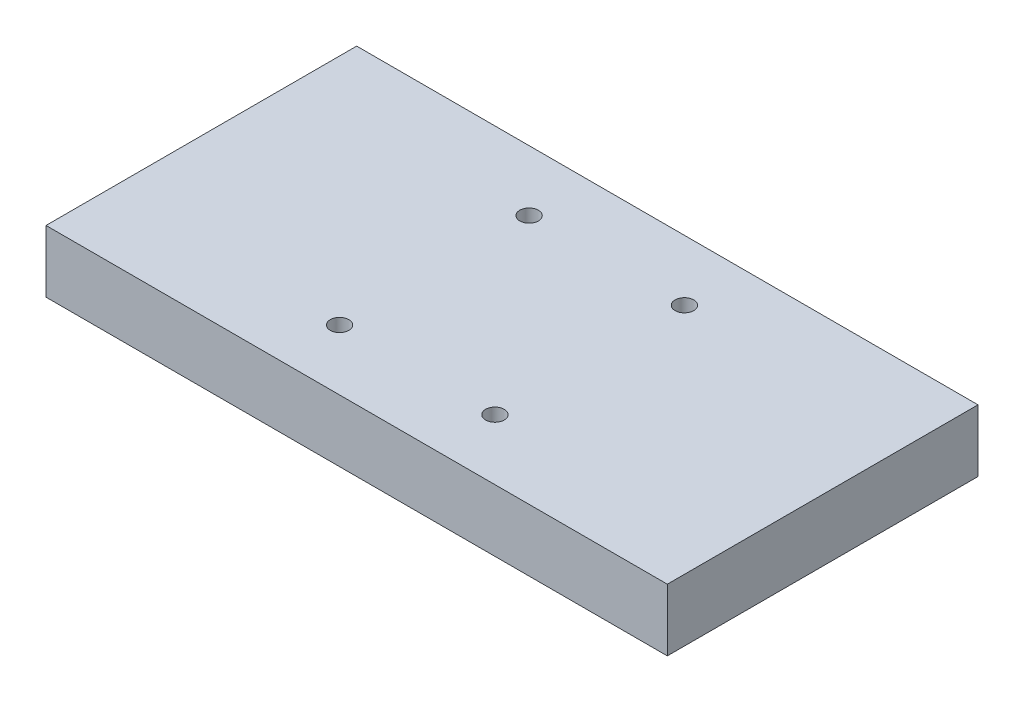
ISO-10303-21;
HEADER;
FILE_DESCRIPTION(('STEP AP214'),'2;1');
FILE_NAME('part.step','',(''),(''),'','','');
FILE_SCHEMA(('AUTOMOTIVE_DESIGN { 1 0 10303 214 1 1 1 1 }'));
ENDSEC;
DATA;
#1=APPLICATION_CONTEXT('core data for automotive mechanical design processes');
#2=APPLICATION_PROTOCOL_DEFINITION('international standard','automotive_design',2000,#1);
#3=PRODUCT_CONTEXT('',#1,'mechanical');
#4=PRODUCT('Part','Part','',(#3));
#5=PRODUCT_RELATED_PRODUCT_CATEGORY('part','',(#4));
#6=PRODUCT_DEFINITION_FORMATION('','',#4);
#7=PRODUCT_DEFINITION_CONTEXT('part definition',#1,'design');
#8=PRODUCT_DEFINITION('design','',#6,#7);
#9=PRODUCT_DEFINITION_SHAPE('','',#8);
#10=(LENGTH_UNIT() NAMED_UNIT(*) SI_UNIT(.MILLI.,.METRE.));
#11=(NAMED_UNIT(*) PLANE_ANGLE_UNIT() SI_UNIT($,.RADIAN.));
#12=(NAMED_UNIT(*) SI_UNIT($,.STERADIAN.) SOLID_ANGLE_UNIT());
#13=UNCERTAINTY_MEASURE_WITH_UNIT(LENGTH_MEASURE(1.E-05),#10,'distance_accuracy_value','');
#14=(GEOMETRIC_REPRESENTATION_CONTEXT(3) GLOBAL_UNCERTAINTY_ASSIGNED_CONTEXT((#13)) GLOBAL_UNIT_ASSIGNED_CONTEXT((#10,
#11,#12)) REPRESENTATION_CONTEXT('',''));
#15=CARTESIAN_POINT('',(0.,0.,0.));
#16=DIRECTION('',(0.,0.,1.));
#17=DIRECTION('',(1.,0.,0.));
#18=AXIS2_PLACEMENT_3D('',#15,#16,#17);
#19=CARTESIAN_POINT('',(-25.,-8.4852813742386,-30.5));
#20=DIRECTION('',(0.,1.,0.));
#21=DIRECTION('',(0.,0.,1.));
#22=AXIS2_PLACEMENT_3D('',#19,#20,#21);
#23=CYLINDRICAL_SURFACE('',#22,3.);
#24=CARTESIAN_POINT('',(-25.,20.,-30.5));
#25=DIRECTION('',(0.,1.,0.));
#26=DIRECTION('',(0.,0.,1.));
#27=AXIS2_PLACEMENT_3D('',#24,#25,#26);
#28=CIRCLE('',#27,3.);
#29=CARTESIAN_POINT('',(-25.,20.,-27.5));
#30=VERTEX_POINT('',#29);
#31=EDGE_CURVE('E114',#30,#30,#28,.T.);
#32=ORIENTED_EDGE('',*,*,#31,.T.);
#33=EDGE_LOOP('',(#32));
#34=FACE_BOUND('',#33,.T.);
#35=CARTESIAN_POINT('',(-25.,10.,-30.5));
#36=DIRECTION('',(0.,-1.,0.));
#37=DIRECTION('',(0.,0.,-1.));
#38=AXIS2_PLACEMENT_3D('',#35,#36,#37);
#39=CIRCLE('',#38,3.);
#40=CARTESIAN_POINT('',(-25.,10.,-33.5));
#41=VERTEX_POINT('',#40);
#42=EDGE_CURVE('E42',#41,#41,#39,.F.);
#43=ORIENTED_EDGE('',*,*,#42,.F.);
#44=EDGE_LOOP('',(#43));
#45=FACE_BOUND('',#44,.T.);
#46=ADVANCED_FACE('F38',(#34,#45),#23,.F.);
#47=CARTESIAN_POINT('',(24.9999999999999,-8.4852813742386,30.5));
#48=DIRECTION('',(0.,1.,0.));
#49=DIRECTION('',(0.,0.,1.));
#50=AXIS2_PLACEMENT_3D('',#47,#48,#49);
#51=CYLINDRICAL_SURFACE('',#50,2.99999999999999);
#52=CARTESIAN_POINT('',(24.9999999999999,20.,30.5));
#53=DIRECTION('',(0.,1.,0.));
#54=DIRECTION('',(0.,0.,1.));
#55=AXIS2_PLACEMENT_3D('',#52,#53,#54);
#56=CIRCLE('',#55,2.99999999999999);
#57=CARTESIAN_POINT('',(24.9999999999999,20.,33.5));
#58=VERTEX_POINT('',#57);
#59=EDGE_CURVE('E151',#58,#58,#56,.T.);
#60=ORIENTED_EDGE('',*,*,#59,.T.);
#61=EDGE_LOOP('',(#60));
#62=FACE_BOUND('',#61,.T.);
#63=CARTESIAN_POINT('',(24.9999999999999,10.,30.5));
#64=DIRECTION('',(0.,-1.,0.));
#65=DIRECTION('',(0.,0.,-1.));
#66=AXIS2_PLACEMENT_3D('',#63,#64,#65);
#67=CIRCLE('',#66,2.99999999999999);
#68=CARTESIAN_POINT('',(24.9999999999999,10.,27.5));
#69=VERTEX_POINT('',#68);
#70=EDGE_CURVE('E133',#69,#69,#67,.F.);
#71=ORIENTED_EDGE('',*,*,#70,.F.);
#72=EDGE_LOOP('',(#71));
#73=FACE_BOUND('',#72,.T.);
#74=ADVANCED_FACE('F227',(#62,#73),#51,.F.);
#75=CARTESIAN_POINT('',(-25.0000000000001,-8.4852813742386,30.5));
#76=DIRECTION('',(0.,1.,0.));
#77=DIRECTION('',(0.,0.,1.));
#78=AXIS2_PLACEMENT_3D('',#75,#76,#77);
#79=CYLINDRICAL_SURFACE('',#78,3.);
#80=CARTESIAN_POINT('',(-25.0000000000001,20.,30.5));
#81=DIRECTION('',(0.,1.,0.));
#82=DIRECTION('',(0.,0.,1.));
#83=AXIS2_PLACEMENT_3D('',#80,#81,#82);
#84=CIRCLE('',#83,3.);
#85=CARTESIAN_POINT('',(-25.0000000000001,20.,33.5));
#86=VERTEX_POINT('',#85);
#87=EDGE_CURVE('E145',#86,#86,#84,.T.);
#88=ORIENTED_EDGE('',*,*,#87,.T.);
#89=EDGE_LOOP('',(#88));
#90=FACE_BOUND('',#89,.T.);
#91=CARTESIAN_POINT('',(-25.0000000000001,10.,30.5));
#92=DIRECTION('',(0.,-1.,0.));
#93=DIRECTION('',(0.,0.,-1.));
#94=AXIS2_PLACEMENT_3D('',#91,#92,#93);
#95=CIRCLE('',#94,3.);
#96=CARTESIAN_POINT('',(-25.0000000000001,10.,27.5));
#97=VERTEX_POINT('',#96);
#98=EDGE_CURVE('E129',#97,#97,#95,.F.);
#99=ORIENTED_EDGE('',*,*,#98,.F.);
#100=EDGE_LOOP('',(#99));
#101=FACE_BOUND('',#100,.T.);
#102=ADVANCED_FACE('F234',(#90,#101),#79,.F.);
#103=CARTESIAN_POINT('',(25.,-8.4852813742386,-30.5));
#104=DIRECTION('',(0.,1.,0.));
#105=DIRECTION('',(0.,0.,1.));
#106=AXIS2_PLACEMENT_3D('',#103,#104,#105);
#107=CYLINDRICAL_SURFACE('',#106,3.00000000000001);
#108=CARTESIAN_POINT('',(25.,20.,-30.5));
#109=DIRECTION('',(0.,1.,0.));
#110=DIRECTION('',(0.,0.,1.));
#111=AXIS2_PLACEMENT_3D('',#108,#109,#110);
#112=CIRCLE('',#111,3.00000000000001);
#113=CARTESIAN_POINT('',(25.,20.,-27.5));
#114=VERTEX_POINT('',#113);
#115=EDGE_CURVE('E140',#114,#114,#112,.T.);
#116=ORIENTED_EDGE('',*,*,#115,.T.);
#117=EDGE_LOOP('',(#116));
#118=FACE_BOUND('',#117,.T.);
#119=CARTESIAN_POINT('',(25.,10.,-30.5));
#120=DIRECTION('',(0.,-1.,0.));
#121=DIRECTION('',(0.,0.,-1.));
#122=AXIS2_PLACEMENT_3D('',#119,#120,#121);
#123=CIRCLE('',#122,3.00000000000001);
#124=CARTESIAN_POINT('',(25.,10.,-33.5));
#125=VERTEX_POINT('',#124);
#126=EDGE_CURVE('E125',#125,#125,#123,.F.);
#127=ORIENTED_EDGE('',*,*,#126,.F.);
#128=EDGE_LOOP('',(#127));
#129=FACE_BOUND('',#128,.T.);
#130=ADVANCED_FACE('F238',(#118,#129),#107,.F.);
#131=CARTESIAN_POINT('',(100.,20.,50.));
#132=DIRECTION('',(-1.,0.,0.));
#133=DIRECTION('',(0.,0.,1.));
#134=AXIS2_PLACEMENT_3D('',#131,#132,#133);
#135=PLANE('',#134);
#136=DIRECTION('',(0.,0.,-1.));
#137=VECTOR('',#136,1.);
#138=CARTESIAN_POINT('',(100.,0.,50.));
#139=LINE('',#138,#137);
#140=CARTESIAN_POINT('',(100.,0.,50.));
#141=VERTEX_POINT('',#140);
#142=CARTESIAN_POINT('',(100.,0.,-50.));
#143=VERTEX_POINT('',#142);
#144=EDGE_CURVE('E110',#141,#143,#139,.T.);
#145=ORIENTED_EDGE('',*,*,#144,.T.);
#146=DIRECTION('',(0.,-1.,0.));
#147=VECTOR('',#146,1.);
#148=CARTESIAN_POINT('',(100.,20.,-50.));
#149=LINE('',#148,#147);
#150=CARTESIAN_POINT('',(100.,20.,-50.));
#151=VERTEX_POINT('',#150);
#152=EDGE_CURVE('E11',#151,#143,#149,.T.);
#153=ORIENTED_EDGE('',*,*,#152,.F.);
#154=DIRECTION('',(0.,0.,-1.));
#155=VECTOR('',#154,1.);
#156=CARTESIAN_POINT('',(100.,20.,50.));
#157=LINE('',#156,#155);
#158=CARTESIAN_POINT('',(100.,20.,50.));
#159=VERTEX_POINT('',#158);
#160=EDGE_CURVE('E93',#159,#151,#157,.T.);
#161=ORIENTED_EDGE('',*,*,#160,.F.);
#162=DIRECTION('',(0.,-1.,0.));
#163=VECTOR('',#162,1.);
#164=CARTESIAN_POINT('',(100.,20.,50.));
#165=LINE('',#164,#163);
#166=EDGE_CURVE('E106',#159,#141,#165,.T.);
#167=ORIENTED_EDGE('',*,*,#166,.T.);
#168=EDGE_LOOP('',(#145,#153,#161,#167));
#169=FACE_BOUND('',#168,.T.);
#170=ADVANCED_FACE('F40',(#169),#135,.F.);
#171=CARTESIAN_POINT('',(-100.,20.,-50.));
#172=DIRECTION('',(0.,0.,1.));
#173=DIRECTION('',(1.,0.,0.));
#174=AXIS2_PLACEMENT_3D('',#171,#172,#173);
#175=PLANE('',#174);
#176=DIRECTION('',(-1.,0.,0.));
#177=VECTOR('',#176,1.);
#178=CARTESIAN_POINT('',(-100.,0.,-50.));
#179=LINE('',#178,#177);
#180=CARTESIAN_POINT('',(-100.,0.,-50.));
#181=VERTEX_POINT('',#180);
#182=EDGE_CURVE('E98',#143,#181,#179,.T.);
#183=ORIENTED_EDGE('',*,*,#182,.T.);
#184=DIRECTION('',(0.,-1.,0.));
#185=VECTOR('',#184,1.);
#186=CARTESIAN_POINT('',(-100.,20.,-50.));
#187=LINE('',#186,#185);
#188=CARTESIAN_POINT('',(-100.,20.,-50.));
#189=VERTEX_POINT('',#188);
#190=EDGE_CURVE('E49',#189,#181,#187,.T.);
#191=ORIENTED_EDGE('',*,*,#190,.F.);
#192=DIRECTION('',(-1.,0.,0.));
#193=VECTOR('',#192,1.);
#194=CARTESIAN_POINT('',(-100.,20.,-50.));
#195=LINE('',#194,#193);
#196=EDGE_CURVE('E88',#151,#189,#195,.T.);
#197=ORIENTED_EDGE('',*,*,#196,.F.);
#198=ORIENTED_EDGE('',*,*,#152,.T.);
#199=EDGE_LOOP('',(#183,#191,#197,#198));
#200=FACE_BOUND('',#199,.T.);
#201=ADVANCED_FACE('F97',(#200),#175,.F.);
#202=CARTESIAN_POINT('',(-100.,20.,50.));
#203=DIRECTION('',(1.,0.,0.));
#204=DIRECTION('',(0.,0.,-1.));
#205=AXIS2_PLACEMENT_3D('',#202,#203,#204);
#206=PLANE('',#205);
#207=DIRECTION('',(0.,0.,1.));
#208=VECTOR('',#207,1.);
#209=CARTESIAN_POINT('',(-100.,0.,50.));
#210=LINE('',#209,#208);
#211=CARTESIAN_POINT('',(-100.,0.,50.));
#212=VERTEX_POINT('',#211);
#213=EDGE_CURVE('E75',#181,#212,#210,.T.);
#214=ORIENTED_EDGE('',*,*,#213,.T.);
#215=DIRECTION('',(0.,-1.,0.));
#216=VECTOR('',#215,1.);
#217=CARTESIAN_POINT('',(-100.,20.,50.));
#218=LINE('',#217,#216);
#219=CARTESIAN_POINT('',(-100.,20.,50.));
#220=VERTEX_POINT('',#219);
#221=EDGE_CURVE('E100',#220,#212,#218,.T.);
#222=ORIENTED_EDGE('',*,*,#221,.F.);
#223=DIRECTION('',(0.,0.,1.));
#224=VECTOR('',#223,1.);
#225=CARTESIAN_POINT('',(-100.,20.,50.));
#226=LINE('',#225,#224);
#227=EDGE_CURVE('E91',#189,#220,#226,.T.);
#228=ORIENTED_EDGE('',*,*,#227,.F.);
#229=ORIENTED_EDGE('',*,*,#190,.T.);
#230=EDGE_LOOP('',(#214,#222,#228,#229));
#231=FACE_BOUND('',#230,.T.);
#232=ADVANCED_FACE('F102',(#231),#206,.F.);
#233=CARTESIAN_POINT('',(-100.,20.,50.));
#234=DIRECTION('',(0.,0.,-1.));
#235=DIRECTION('',(-1.,0.,0.));
#236=AXIS2_PLACEMENT_3D('',#233,#234,#235);
#237=PLANE('',#236);
#238=DIRECTION('',(1.,0.,0.));
#239=VECTOR('',#238,1.);
#240=CARTESIAN_POINT('',(-100.,0.,50.));
#241=LINE('',#240,#239);
#242=EDGE_CURVE('E81',#212,#141,#241,.T.);
#243=ORIENTED_EDGE('',*,*,#242,.T.);
#244=ORIENTED_EDGE('',*,*,#166,.F.);
#245=DIRECTION('',(1.,0.,0.));
#246=VECTOR('',#245,1.);
#247=CARTESIAN_POINT('',(-100.,20.,50.));
#248=LINE('',#247,#246);
#249=EDGE_CURVE('E58',#220,#159,#248,.T.);
#250=ORIENTED_EDGE('',*,*,#249,.F.);
#251=ORIENTED_EDGE('',*,*,#221,.T.);
#252=EDGE_LOOP('',(#243,#244,#250,#251));
#253=FACE_BOUND('',#252,.T.);
#254=ADVANCED_FACE('F215',(#253),#237,.F.);
#255=CARTESIAN_POINT('',(0.,20.,0.));
#256=DIRECTION('',(0.,-1.,0.));
#257=DIRECTION('',(0.,0.,-1.));
#258=AXIS2_PLACEMENT_3D('',#255,#256,#257);
#259=PLANE('',#258);
#260=ORIENTED_EDGE('',*,*,#115,.F.);
#261=EDGE_LOOP('',(#260));
#262=FACE_BOUND('',#261,.T.);
#263=ORIENTED_EDGE('',*,*,#87,.F.);
#264=EDGE_LOOP('',(#263));
#265=FACE_BOUND('',#264,.T.);
#266=ORIENTED_EDGE('',*,*,#59,.F.);
#267=EDGE_LOOP('',(#266));
#268=FACE_BOUND('',#267,.T.);
#269=ORIENTED_EDGE('',*,*,#31,.F.);
#270=EDGE_LOOP('',(#269));
#271=FACE_BOUND('',#270,.T.);
#272=ORIENTED_EDGE('',*,*,#160,.T.);
#273=ORIENTED_EDGE('',*,*,#196,.T.);
#274=ORIENTED_EDGE('',*,*,#227,.T.);
#275=ORIENTED_EDGE('',*,*,#249,.T.);
#276=EDGE_LOOP('',(#272,#273,#274,#275));
#277=FACE_BOUND('',#276,.T.);
#278=ADVANCED_FACE('F89',(#262,#265,#268,#271,#277),#259,.F.);
#279=CARTESIAN_POINT('',(0.,0.,0.));
#280=DIRECTION('',(0.,-1.,0.));
#281=DIRECTION('',(0.,0.,-1.));
#282=AXIS2_PLACEMENT_3D('',#279,#280,#281);
#283=PLANE('',#282);
#284=CARTESIAN_POINT('',(-25.,0.,-30.5));
#285=DIRECTION('',(0.,-1.,0.));
#286=DIRECTION('',(0.,0.,-1.));
#287=AXIS2_PLACEMENT_3D('',#284,#285,#286);
#288=CIRCLE('',#287,6.);
#289=CARTESIAN_POINT('',(-25.,0.,-36.5));
#290=VERTEX_POINT('',#289);
#291=EDGE_CURVE('E180',#290,#290,#288,.T.);
#292=ORIENTED_EDGE('',*,*,#291,.F.);
#293=EDGE_LOOP('',(#292));
#294=FACE_BOUND('',#293,.T.);
#295=CARTESIAN_POINT('',(25.,0.,30.5));
#296=DIRECTION('',(0.,-1.,0.));
#297=DIRECTION('',(0.,0.,-1.));
#298=AXIS2_PLACEMENT_3D('',#295,#296,#297);
#299=CIRCLE('',#298,6.);
#300=CARTESIAN_POINT('',(25.,0.,24.5));
#301=VERTEX_POINT('',#300);
#302=EDGE_CURVE('E171',#301,#301,#299,.T.);
#303=ORIENTED_EDGE('',*,*,#302,.F.);
#304=EDGE_LOOP('',(#303));
#305=FACE_BOUND('',#304,.T.);
#306=CARTESIAN_POINT('',(-25.,0.,30.5));
#307=DIRECTION('',(0.,-1.,0.));
#308=DIRECTION('',(0.,0.,-1.));
#309=AXIS2_PLACEMENT_3D('',#306,#307,#308);
#310=CIRCLE('',#309,6.);
#311=CARTESIAN_POINT('',(-25.,0.,24.5));
#312=VERTEX_POINT('',#311);
#313=EDGE_CURVE('E187',#312,#312,#310,.T.);
#314=ORIENTED_EDGE('',*,*,#313,.F.);
#315=EDGE_LOOP('',(#314));
#316=FACE_BOUND('',#315,.T.);
#317=CARTESIAN_POINT('',(25.,0.,-30.5));
#318=DIRECTION('',(0.,-1.,0.));
#319=DIRECTION('',(0.,0.,-1.));
#320=AXIS2_PLACEMENT_3D('',#317,#318,#319);
#321=CIRCLE('',#320,6.);
#322=CARTESIAN_POINT('',(25.,0.,-36.5));
#323=VERTEX_POINT('',#322);
#324=EDGE_CURVE('E163',#323,#323,#321,.T.);
#325=ORIENTED_EDGE('',*,*,#324,.F.);
#326=EDGE_LOOP('',(#325));
#327=FACE_BOUND('',#326,.T.);
#328=ORIENTED_EDGE('',*,*,#144,.F.);
#329=ORIENTED_EDGE('',*,*,#242,.F.);
#330=ORIENTED_EDGE('',*,*,#213,.F.);
#331=ORIENTED_EDGE('',*,*,#182,.F.);
#332=EDGE_LOOP('',(#328,#329,#330,#331));
#333=FACE_BOUND('',#332,.T.);
#334=ADVANCED_FACE('F205',(#294,#305,#316,#327,#333),#283,.T.);
#335=CARTESIAN_POINT('',(25.,10.,-30.5));
#336=DIRECTION('',(0.,-1.,0.));
#337=DIRECTION('',(0.,0.,-1.));
#338=AXIS2_PLACEMENT_3D('',#335,#336,#337);
#339=PLANE('',#338);
#340=CARTESIAN_POINT('',(25.,10.,-30.5));
#341=DIRECTION('',(0.,-1.,0.));
#342=DIRECTION('',(0.,0.,-1.));
#343=AXIS2_PLACEMENT_3D('',#340,#341,#342);
#344=CIRCLE('',#343,6.);
#345=CARTESIAN_POINT('',(25.,10.,-36.5));
#346=VERTEX_POINT('',#345);
#347=EDGE_CURVE('E130',#346,#346,#344,.T.);
#348=ORIENTED_EDGE('',*,*,#347,.T.);
#349=EDGE_LOOP('',(#348));
#350=FACE_BOUND('',#349,.T.);
#351=ORIENTED_EDGE('',*,*,#126,.T.);
#352=EDGE_LOOP('',(#351));
#353=FACE_BOUND('',#352,.T.);
#354=ADVANCED_FACE('F208',(#350,#353),#339,.T.);
#355=CARTESIAN_POINT('',(25.,10.,-30.5));
#356=DIRECTION('',(0.,-1.,0.));
#357=DIRECTION('',(0.,0.,-1.));
#358=AXIS2_PLACEMENT_3D('',#355,#356,#357);
#359=CYLINDRICAL_SURFACE('',#358,6.);
#360=ORIENTED_EDGE('',*,*,#347,.F.);
#361=EDGE_LOOP('',(#360));
#362=FACE_BOUND('',#361,.T.);
#363=ORIENTED_EDGE('',*,*,#324,.T.);
#364=EDGE_LOOP('',(#363));
#365=FACE_BOUND('',#364,.T.);
#366=ADVANCED_FACE('F244',(#362,#365),#359,.F.);
#367=CARTESIAN_POINT('',(-25.,10.,30.5));
#368=DIRECTION('',(0.,-1.,0.));
#369=DIRECTION('',(0.,0.,-1.));
#370=AXIS2_PLACEMENT_3D('',#367,#368,#369);
#371=PLANE('',#370);
#372=CARTESIAN_POINT('',(-25.,10.,30.5));
#373=DIRECTION('',(0.,-1.,0.));
#374=DIRECTION('',(0.,0.,-1.));
#375=AXIS2_PLACEMENT_3D('',#372,#373,#374);
#376=CIRCLE('',#375,6.);
#377=CARTESIAN_POINT('',(-25.,10.,24.5));
#378=VERTEX_POINT('',#377);
#379=EDGE_CURVE('E176',#378,#378,#376,.T.);
#380=ORIENTED_EDGE('',*,*,#379,.T.);
#381=EDGE_LOOP('',(#380));
#382=FACE_BOUND('',#381,.T.);
#383=ORIENTED_EDGE('',*,*,#98,.T.);
#384=EDGE_LOOP('',(#383));
#385=FACE_BOUND('',#384,.T.);
#386=ADVANCED_FACE('F195',(#382,#385),#371,.T.);
#387=CARTESIAN_POINT('',(-25.,10.,30.5));
#388=DIRECTION('',(0.,-1.,0.));
#389=DIRECTION('',(0.,0.,-1.));
#390=AXIS2_PLACEMENT_3D('',#387,#388,#389);
#391=CYLINDRICAL_SURFACE('',#390,6.);
#392=ORIENTED_EDGE('',*,*,#379,.F.);
#393=EDGE_LOOP('',(#392));
#394=FACE_BOUND('',#393,.T.);
#395=ORIENTED_EDGE('',*,*,#313,.T.);
#396=EDGE_LOOP('',(#395));
#397=FACE_BOUND('',#396,.T.);
#398=ADVANCED_FACE('F198',(#394,#397),#391,.F.);
#399=CARTESIAN_POINT('',(25.,10.,30.5));
#400=DIRECTION('',(0.,-1.,0.));
#401=DIRECTION('',(0.,0.,-1.));
#402=AXIS2_PLACEMENT_3D('',#399,#400,#401);
#403=PLANE('',#402);
#404=CARTESIAN_POINT('',(25.,10.,30.5));
#405=DIRECTION('',(0.,-1.,0.));
#406=DIRECTION('',(0.,0.,-1.));
#407=AXIS2_PLACEMENT_3D('',#404,#405,#406);
#408=CIRCLE('',#407,6.);
#409=CARTESIAN_POINT('',(25.,10.,24.5));
#410=VERTEX_POINT('',#409);
#411=EDGE_CURVE('E175',#410,#410,#408,.T.);
#412=ORIENTED_EDGE('',*,*,#411,.T.);
#413=EDGE_LOOP('',(#412));
#414=FACE_BOUND('',#413,.T.);
#415=ORIENTED_EDGE('',*,*,#70,.T.);
#416=EDGE_LOOP('',(#415));
#417=FACE_BOUND('',#416,.T.);
#418=ADVANCED_FACE('F201',(#414,#417),#403,.T.);
#419=CARTESIAN_POINT('',(25.,10.,30.5));
#420=DIRECTION('',(0.,-1.,0.));
#421=DIRECTION('',(0.,0.,-1.));
#422=AXIS2_PLACEMENT_3D('',#419,#420,#421);
#423=CYLINDRICAL_SURFACE('',#422,6.);
#424=ORIENTED_EDGE('',*,*,#411,.F.);
#425=EDGE_LOOP('',(#424));
#426=FACE_BOUND('',#425,.T.);
#427=ORIENTED_EDGE('',*,*,#302,.T.);
#428=EDGE_LOOP('',(#427));
#429=FACE_BOUND('',#428,.T.);
#430=ADVANCED_FACE('F251',(#426,#429),#423,.F.);
#431=CARTESIAN_POINT('',(-25.,10.,-30.5));
#432=DIRECTION('',(0.,-1.,0.));
#433=DIRECTION('',(0.,0.,-1.));
#434=AXIS2_PLACEMENT_3D('',#431,#432,#433);
#435=PLANE('',#434);
#436=CARTESIAN_POINT('',(-25.,10.,-30.5));
#437=DIRECTION('',(0.,-1.,0.));
#438=DIRECTION('',(0.,0.,-1.));
#439=AXIS2_PLACEMENT_3D('',#436,#437,#438);
#440=CIRCLE('',#439,6.);
#441=CARTESIAN_POINT('',(-25.,10.,-36.5));
#442=VERTEX_POINT('',#441);
#443=EDGE_CURVE('E167',#442,#442,#440,.T.);
#444=ORIENTED_EDGE('',*,*,#443,.T.);
#445=EDGE_LOOP('',(#444));
#446=FACE_BOUND('',#445,.T.);
#447=ORIENTED_EDGE('',*,*,#42,.T.);
#448=EDGE_LOOP('',(#447));
#449=FACE_BOUND('',#448,.T.);
#450=ADVANCED_FACE('F254',(#446,#449),#435,.T.);
#451=CARTESIAN_POINT('',(-25.,10.,-30.5));
#452=DIRECTION('',(0.,-1.,0.));
#453=DIRECTION('',(0.,0.,-1.));
#454=AXIS2_PLACEMENT_3D('',#451,#452,#453);
#455=CYLINDRICAL_SURFACE('',#454,6.);
#456=ORIENTED_EDGE('',*,*,#443,.F.);
#457=EDGE_LOOP('',(#456));
#458=FACE_BOUND('',#457,.T.);
#459=ORIENTED_EDGE('',*,*,#291,.T.);
#460=EDGE_LOOP('',(#459));
#461=FACE_BOUND('',#460,.T.);
#462=ADVANCED_FACE('F259',(#458,#461),#455,.F.);
#463=CLOSED_SHELL('',(#46,#74,#102,#130,#170,#201,#232,#254,#278,#334,#354,#366,#386,#398,#418,
#430,#450,#462));
#464=MANIFOLD_SOLID_BREP('B2',#463);
#465=ADVANCED_BREP_SHAPE_REPRESENTATION('',(#18,#464),#14);
#466=SHAPE_DEFINITION_REPRESENTATION(#9,#465);
ENDSEC;
END-ISO-10303-21;
